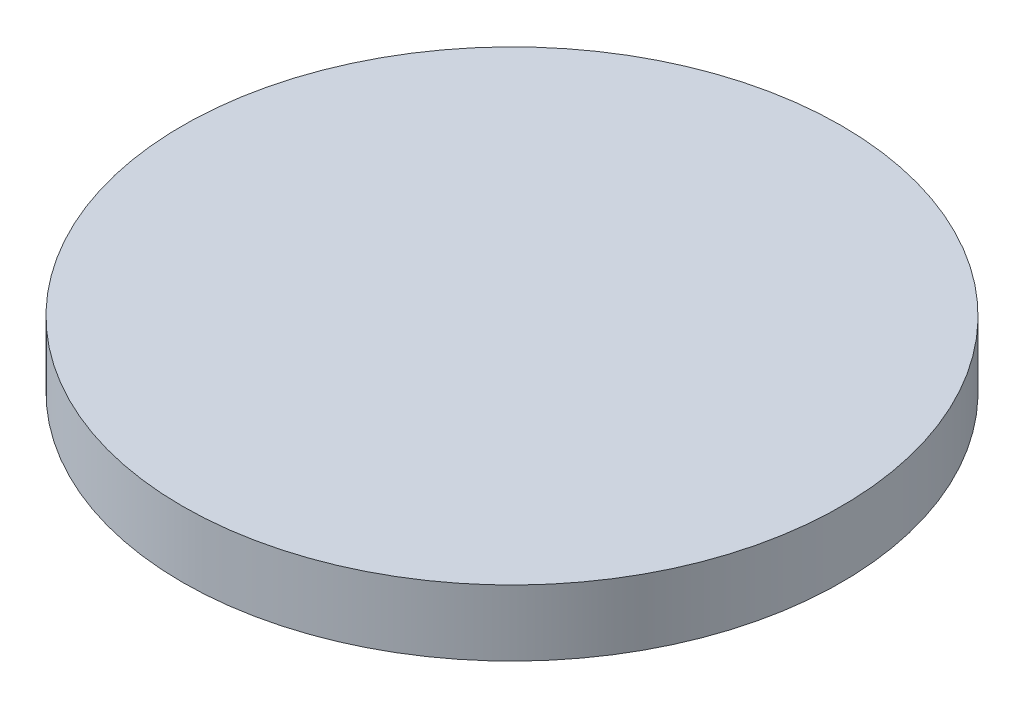
ISO-10303-21;
HEADER;
FILE_DESCRIPTION(('STEP AP214'),'2;1');
FILE_NAME('part.step','',(''),(''),'','','');
FILE_SCHEMA(('AUTOMOTIVE_DESIGN { 1 0 10303 214 1 1 1 1 }'));
ENDSEC;
DATA;
#1=APPLICATION_CONTEXT('core data for automotive mechanical design processes');
#2=APPLICATION_PROTOCOL_DEFINITION('international standard','automotive_design',2000,#1);
#3=PRODUCT_CONTEXT('',#1,'mechanical');
#4=PRODUCT('Part','Part','',(#3));
#5=PRODUCT_RELATED_PRODUCT_CATEGORY('part','',(#4));
#6=PRODUCT_DEFINITION_FORMATION('','',#4);
#7=PRODUCT_DEFINITION_CONTEXT('part definition',#1,'design');
#8=PRODUCT_DEFINITION('design','',#6,#7);
#9=PRODUCT_DEFINITION_SHAPE('','',#8);
#10=(LENGTH_UNIT() NAMED_UNIT(*) SI_UNIT(.MILLI.,.METRE.));
#11=(NAMED_UNIT(*) PLANE_ANGLE_UNIT() SI_UNIT($,.RADIAN.));
#12=(NAMED_UNIT(*) SI_UNIT($,.STERADIAN.) SOLID_ANGLE_UNIT());
#13=UNCERTAINTY_MEASURE_WITH_UNIT(LENGTH_MEASURE(1.E-05),#10,'distance_accuracy_value','');
#14=(GEOMETRIC_REPRESENTATION_CONTEXT(3) GLOBAL_UNCERTAINTY_ASSIGNED_CONTEXT((#13)) GLOBAL_UNIT_ASSIGNED_CONTEXT((#10,
#11,#12)) REPRESENTATION_CONTEXT('',''));
#15=CARTESIAN_POINT('',(0.,0.,0.));
#16=DIRECTION('',(0.,0.,1.));
#17=DIRECTION('',(1.,0.,0.));
#18=AXIS2_PLACEMENT_3D('',#15,#16,#17);
#19=CARTESIAN_POINT('',(0.,0.1,0.));
#20=DIRECTION('',(0.,1.,0.));
#21=DIRECTION('',(0.,0.,1.));
#22=AXIS2_PLACEMENT_3D('',#19,#20,#21);
#23=PLANE('',#22);
#24=CARTESIAN_POINT('',(0.,0.1,0.));
#25=DIRECTION('',(0.,1.,0.));
#26=DIRECTION('',(0.,0.,1.));
#27=AXIS2_PLACEMENT_3D('',#24,#25,#26);
#28=CIRCLE('',#27,0.5);
#29=CARTESIAN_POINT('',(0.,0.1,0.5));
#30=VERTEX_POINT('',#29);
#31=EDGE_CURVE('E17',#30,#30,#28,.F.);
#32=ORIENTED_EDGE('',*,*,#31,.F.);
#33=EDGE_LOOP('',(#32));
#34=FACE_BOUND('',#33,.T.);
#35=ADVANCED_FACE('F14',(#34),#23,.T.);
#36=CARTESIAN_POINT('',(0.,0.,0.));
#37=DIRECTION('',(0.,1.,0.));
#38=DIRECTION('',(0.,0.,1.));
#39=AXIS2_PLACEMENT_3D('',#36,#37,#38);
#40=CYLINDRICAL_SURFACE('',#39,0.5);
#41=CARTESIAN_POINT('',(0.,0.,0.));
#42=DIRECTION('',(0.,1.,0.));
#43=DIRECTION('',(0.,0.,1.));
#44=AXIS2_PLACEMENT_3D('',#41,#42,#43);
#45=CIRCLE('',#44,0.5);
#46=CARTESIAN_POINT('',(0.,0.,0.5));
#47=VERTEX_POINT('',#46);
#48=EDGE_CURVE('E10',#47,#47,#45,.T.);
#49=ORIENTED_EDGE('',*,*,#48,.T.);
#50=EDGE_LOOP('',(#49));
#51=FACE_BOUND('',#50,.T.);
#52=ORIENTED_EDGE('',*,*,#31,.T.);
#53=EDGE_LOOP('',(#52));
#54=FACE_BOUND('',#53,.T.);
#55=ADVANCED_FACE('F26',(#51,#54),#40,.T.);
#56=CARTESIAN_POINT('',(0.,0.,0.));
#57=DIRECTION('',(0.,1.,0.));
#58=DIRECTION('',(0.,0.,1.));
#59=AXIS2_PLACEMENT_3D('',#56,#57,#58);
#60=PLANE('',#59);
#61=ORIENTED_EDGE('',*,*,#48,.F.);
#62=EDGE_LOOP('',(#61));
#63=FACE_BOUND('',#62,.T.);
#64=ADVANCED_FACE('F33',(#63),#60,.F.);
#65=CLOSED_SHELL('',(#35,#55,#64));
#66=MANIFOLD_SOLID_BREP('B1',#65);
#67=ADVANCED_BREP_SHAPE_REPRESENTATION('',(#18,#66),#14);
#68=SHAPE_DEFINITION_REPRESENTATION(#9,#67);
ENDSEC;
END-ISO-10303-21;
